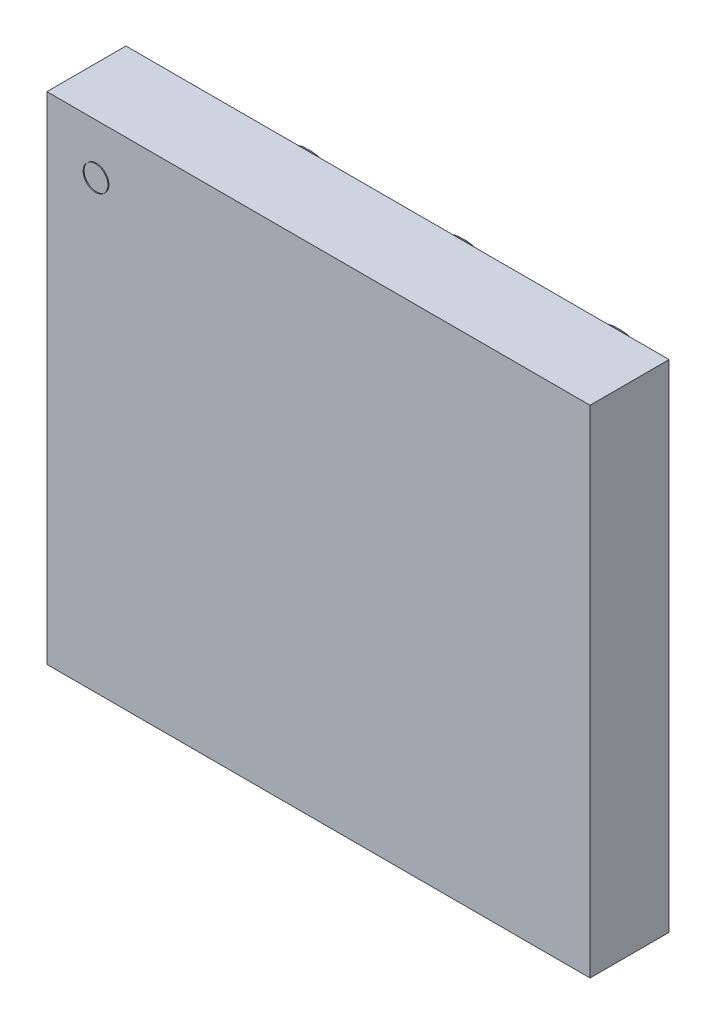
ISO-10303-21;
HEADER;
FILE_DESCRIPTION(('STEP AP214'),'2;1');
FILE_NAME('part.step','',(''),(''),'','','');
FILE_SCHEMA(('AUTOMOTIVE_DESIGN { 1 0 10303 214 1 1 1 1 }'));
ENDSEC;
DATA;
#1=APPLICATION_CONTEXT('core data for automotive mechanical design processes');
#2=APPLICATION_PROTOCOL_DEFINITION('international standard','automotive_design',2000,#1);
#3=PRODUCT_CONTEXT('',#1,'mechanical');
#4=PRODUCT('Part','Part','',(#3));
#5=PRODUCT_RELATED_PRODUCT_CATEGORY('part','',(#4));
#6=PRODUCT_DEFINITION_FORMATION('','',#4);
#7=PRODUCT_DEFINITION_CONTEXT('part definition',#1,'design');
#8=PRODUCT_DEFINITION('design','',#6,#7);
#9=PRODUCT_DEFINITION_SHAPE('','',#8);
#10=(LENGTH_UNIT() NAMED_UNIT(*) SI_UNIT(.MILLI.,.METRE.));
#11=(NAMED_UNIT(*) PLANE_ANGLE_UNIT() SI_UNIT($,.RADIAN.));
#12=(NAMED_UNIT(*) SI_UNIT($,.STERADIAN.) SOLID_ANGLE_UNIT());
#13=UNCERTAINTY_MEASURE_WITH_UNIT(LENGTH_MEASURE(1.E-05),#10,'distance_accuracy_value','');
#14=(GEOMETRIC_REPRESENTATION_CONTEXT(3) GLOBAL_UNCERTAINTY_ASSIGNED_CONTEXT((#13)) GLOBAL_UNIT_ASSIGNED_CONTEXT((#10,
#11,#12)) REPRESENTATION_CONTEXT('',''));
#15=CARTESIAN_POINT('',(0.,0.,0.));
#16=DIRECTION('',(0.,0.,1.));
#17=DIRECTION('',(1.,0.,0.));
#18=AXIS2_PLACEMENT_3D('',#15,#16,#17);
#19=CARTESIAN_POINT('',(-0.5,0.5,-0.123));
#20=DIRECTION('',(-1.,0.,0.));
#21=DIRECTION('',(0.,1.,0.));
#22=AXIS2_PLACEMENT_3D('',#19,#20,#21);
#23=SPHERICAL_SURFACE('',#22,0.127);
#24=CARTESIAN_POINT('',(-0.373,0.5,-0.123));
#25=VERTEX_POINT('',#24);
#26=VERTEX_LOOP('',#25);
#27=FACE_BOUND('',#26,.T.);
#28=CARTESIAN_POINT('',(-0.627,0.5,-0.123));
#29=VERTEX_POINT('',#28);
#30=VERTEX_LOOP('',#29);
#31=FACE_BOUND('',#30,.T.);
#32=ADVANCED_FACE('P0_F15',(#27,#31),#23,.T.);
#33=CLOSED_SHELL('',(#32));
#34=MANIFOLD_SOLID_BREP('P0_B1',#33);
#35=CARTESIAN_POINT('',(-0.5,0.,-0.123));
#36=DIRECTION('',(-1.,0.,0.));
#37=DIRECTION('',(0.,1.,0.));
#38=AXIS2_PLACEMENT_3D('',#35,#36,#37);
#39=SPHERICAL_SURFACE('',#38,0.127);
#40=CARTESIAN_POINT('',(-0.373,0.,-0.123));
#41=VERTEX_POINT('',#40);
#42=VERTEX_LOOP('',#41);
#43=FACE_BOUND('',#42,.T.);
#44=CARTESIAN_POINT('',(-0.627,0.,-0.123));
#45=VERTEX_POINT('',#44);
#46=VERTEX_LOOP('',#45);
#47=FACE_BOUND('',#46,.T.);
#48=ADVANCED_FACE('P1_F15',(#43,#47),#39,.T.);
#49=CLOSED_SHELL('',(#48));
#50=MANIFOLD_SOLID_BREP('P1_B1',#49);
#51=CARTESIAN_POINT('',(0.,0.5,-0.123));
#52=DIRECTION('',(-1.,0.,0.));
#53=DIRECTION('',(0.,1.,0.));
#54=AXIS2_PLACEMENT_3D('',#51,#52,#53);
#55=SPHERICAL_SURFACE('',#54,0.127);
#56=CARTESIAN_POINT('',(0.127,0.5,-0.123));
#57=VERTEX_POINT('',#56);
#58=VERTEX_LOOP('',#57);
#59=FACE_BOUND('',#58,.T.);
#60=CARTESIAN_POINT('',(-0.127,0.5,-0.123));
#61=VERTEX_POINT('',#60);
#62=VERTEX_LOOP('',#61);
#63=FACE_BOUND('',#62,.T.);
#64=ADVANCED_FACE('P2_F15',(#59,#63),#55,.T.);
#65=CLOSED_SHELL('',(#64));
#66=MANIFOLD_SOLID_BREP('P2_B1',#65);
#67=CARTESIAN_POINT('',(0.5,-0.5,-0.123));
#68=DIRECTION('',(-1.,0.,0.));
#69=DIRECTION('',(0.,1.,0.));
#70=AXIS2_PLACEMENT_3D('',#67,#68,#69);
#71=SPHERICAL_SURFACE('',#70,0.127);
#72=CARTESIAN_POINT('',(0.627,-0.5,-0.123));
#73=VERTEX_POINT('',#72);
#74=VERTEX_LOOP('',#73);
#75=FACE_BOUND('',#74,.T.);
#76=CARTESIAN_POINT('',(0.373,-0.5,-0.123));
#77=VERTEX_POINT('',#76);
#78=VERTEX_LOOP('',#77);
#79=FACE_BOUND('',#78,.T.);
#80=ADVANCED_FACE('P3_F15',(#75,#79),#71,.T.);
#81=CLOSED_SHELL('',(#80));
#82=MANIFOLD_SOLID_BREP('P3_B1',#81);
#83=CARTESIAN_POINT('',(-0.876,-0.8,0.258));
#84=DIRECTION('',(0.,0.,1.));
#85=DIRECTION('',(1.,0.,0.));
#86=AXIS2_PLACEMENT_3D('',#83,#84,#85);
#87=PLANE('',#86);
#88=DIRECTION('',(1.,0.,0.));
#89=VECTOR('',#88,1.);
#90=CARTESIAN_POINT('',(0.876,0.8,0.258));
#91=LINE('',#90,#89);
#92=CARTESIAN_POINT('',(-0.876,0.8,0.258));
#93=VERTEX_POINT('',#92);
#94=CARTESIAN_POINT('',(0.876,0.8,0.258));
#95=VERTEX_POINT('',#94);
#96=EDGE_CURVE('P4_E61',#93,#95,#91,.T.);
#97=ORIENTED_EDGE('',*,*,#96,.F.);
#98=DIRECTION('',(0.,1.,0.));
#99=VECTOR('',#98,1.);
#100=CARTESIAN_POINT('',(-0.876,-0.8,0.258));
#101=LINE('',#100,#99);
#102=CARTESIAN_POINT('',(-0.876,-0.8,0.258));
#103=VERTEX_POINT('',#102);
#104=EDGE_CURVE('P4_E19',#93,#103,#101,.F.);
#105=ORIENTED_EDGE('',*,*,#104,.T.);
#106=DIRECTION('',(1.,0.,0.));
#107=VECTOR('',#106,1.);
#108=CARTESIAN_POINT('',(-0.876,-0.8,0.258));
#109=LINE('',#108,#107);
#110=CARTESIAN_POINT('',(0.876,-0.8,0.258));
#111=VERTEX_POINT('',#110);
#112=EDGE_CURVE('P4_E68',#111,#103,#109,.F.);
#113=ORIENTED_EDGE('',*,*,#112,.F.);
#114=DIRECTION('',(0.,1.,0.));
#115=VECTOR('',#114,1.);
#116=CARTESIAN_POINT('',(0.876,-0.8,0.258));
#117=LINE('',#116,#115);
#118=EDGE_CURVE('P4_E55',#95,#111,#117,.F.);
#119=ORIENTED_EDGE('',*,*,#118,.F.);
#120=EDGE_LOOP('',(#97,#105,#113,#119));
#121=FACE_BOUND('',#120,.T.);
#122=ADVANCED_FACE('P4_F16',(#121),#87,.T.);
#123=CARTESIAN_POINT('',(0.876,0.8,0.00300000000000009));
#124=DIRECTION('',(0.,1.,0.));
#125=DIRECTION('',(0.,0.,1.));
#126=AXIS2_PLACEMENT_3D('',#123,#124,#125);
#127=PLANE('',#126);
#128=ORIENTED_EDGE('',*,*,#96,.T.);
#129=DIRECTION('',(0.,0.,-1.));
#130=VECTOR('',#129,1.);
#131=CARTESIAN_POINT('',(0.876,0.8,0.00300000000000009));
#132=LINE('',#131,#130);
#133=CARTESIAN_POINT('',(0.876,0.8,0.00300000000000009));
#134=VERTEX_POINT('',#133);
#135=EDGE_CURVE('P4_E63',#134,#95,#132,.F.);
#136=ORIENTED_EDGE('',*,*,#135,.F.);
#137=DIRECTION('',(-1.,0.,0.));
#138=VECTOR('',#137,1.);
#139=CARTESIAN_POINT('',(-0.876,0.8,0.00300000000000009));
#140=LINE('',#139,#138);
#141=CARTESIAN_POINT('',(-0.876,0.8,0.00300000000000009));
#142=VERTEX_POINT('',#141);
#143=EDGE_CURVE('P4_E82',#142,#134,#140,.F.);
#144=ORIENTED_EDGE('',*,*,#143,.F.);
#145=DIRECTION('',(0.,0.,1.));
#146=VECTOR('',#145,1.);
#147=CARTESIAN_POINT('',(-0.876,0.8,0.00300000000000009));
#148=LINE('',#147,#146);
#149=EDGE_CURVE('P4_E66',#93,#142,#148,.F.);
#150=ORIENTED_EDGE('',*,*,#149,.F.);
#151=EDGE_LOOP('',(#128,#136,#144,#150));
#152=FACE_BOUND('',#151,.T.);
#153=ADVANCED_FACE('P4_F62',(#152),#127,.T.);
#154=CARTESIAN_POINT('',(0.876,-0.8,0.00300000000000009));
#155=DIRECTION('',(1.,0.,0.));
#156=DIRECTION('',(0.,0.,-1.));
#157=AXIS2_PLACEMENT_3D('',#154,#155,#156);
#158=PLANE('',#157);
#159=ORIENTED_EDGE('',*,*,#118,.T.);
#160=DIRECTION('',(0.,0.,-1.));
#161=VECTOR('',#160,1.);
#162=CARTESIAN_POINT('',(0.876,-0.8,0.00300000000000009));
#163=LINE('',#162,#161);
#164=CARTESIAN_POINT('',(0.876,-0.8,0.00300000000000009));
#165=VERTEX_POINT('',#164);
#166=EDGE_CURVE('P4_E70',#165,#111,#163,.F.);
#167=ORIENTED_EDGE('',*,*,#166,.F.);
#168=DIRECTION('',(0.,1.,0.));
#169=VECTOR('',#168,1.);
#170=CARTESIAN_POINT('',(0.876,0.8,0.00300000000000009));
#171=LINE('',#170,#169);
#172=EDGE_CURVE('P4_E74',#134,#165,#171,.F.);
#173=ORIENTED_EDGE('',*,*,#172,.F.);
#174=ORIENTED_EDGE('',*,*,#135,.T.);
#175=EDGE_LOOP('',(#159,#167,#173,#174));
#176=FACE_BOUND('',#175,.T.);
#177=ADVANCED_FACE('P4_F72',(#176),#158,.T.);
#178=CARTESIAN_POINT('',(-0.876,-0.8,0.00300000000000009));
#179=DIRECTION('',(0.,-1.,0.));
#180=DIRECTION('',(0.,0.,-1.));
#181=AXIS2_PLACEMENT_3D('',#178,#179,#180);
#182=PLANE('',#181);
#183=ORIENTED_EDGE('',*,*,#112,.T.);
#184=DIRECTION('',(0.,0.,1.));
#185=VECTOR('',#184,1.);
#186=CARTESIAN_POINT('',(-0.876,-0.8,0.00300000000000009));
#187=LINE('',#186,#185);
#188=CARTESIAN_POINT('',(-0.876,-0.8,0.00300000000000009));
#189=VERTEX_POINT('',#188);
#190=EDGE_CURVE('P4_E34',#189,#103,#187,.T.);
#191=ORIENTED_EDGE('',*,*,#190,.F.);
#192=DIRECTION('',(-1.,0.,0.));
#193=VECTOR('',#192,1.);
#194=CARTESIAN_POINT('',(-0.876,-0.8,0.00300000000000009));
#195=LINE('',#194,#193);
#196=EDGE_CURVE('P4_E25',#165,#189,#195,.T.);
#197=ORIENTED_EDGE('',*,*,#196,.F.);
#198=ORIENTED_EDGE('',*,*,#166,.T.);
#199=EDGE_LOOP('',(#183,#191,#197,#198));
#200=FACE_BOUND('',#199,.T.);
#201=ADVANCED_FACE('P4_F88',(#200),#182,.T.);
#202=CARTESIAN_POINT('',(-0.876,0.8,0.00300000000000009));
#203=DIRECTION('',(-1.,0.,0.));
#204=DIRECTION('',(0.,0.,1.));
#205=AXIS2_PLACEMENT_3D('',#202,#203,#204);
#206=PLANE('',#205);
#207=ORIENTED_EDGE('',*,*,#104,.F.);
#208=ORIENTED_EDGE('',*,*,#149,.T.);
#209=DIRECTION('',(0.,1.,0.));
#210=VECTOR('',#209,1.);
#211=CARTESIAN_POINT('',(-0.876,0.8,0.00300000000000009));
#212=LINE('',#211,#210);
#213=EDGE_CURVE('P4_E11',#189,#142,#212,.T.);
#214=ORIENTED_EDGE('',*,*,#213,.F.);
#215=ORIENTED_EDGE('',*,*,#190,.T.);
#216=EDGE_LOOP('',(#207,#208,#214,#215));
#217=FACE_BOUND('',#216,.T.);
#218=ADVANCED_FACE('P4_F90',(#217),#206,.T.);
#219=CARTESIAN_POINT('',(-0.876,0.8,0.00300000000000009));
#220=DIRECTION('',(0.,0.,-1.));
#221=DIRECTION('',(-1.,0.,0.));
#222=AXIS2_PLACEMENT_3D('',#219,#220,#221);
#223=PLANE('',#222);
#224=ORIENTED_EDGE('',*,*,#196,.T.);
#225=ORIENTED_EDGE('',*,*,#213,.T.);
#226=ORIENTED_EDGE('',*,*,#143,.T.);
#227=ORIENTED_EDGE('',*,*,#172,.T.);
#228=EDGE_LOOP('',(#224,#225,#226,#227));
#229=FACE_BOUND('',#228,.T.);
#230=ADVANCED_FACE('P4_F87',(#229),#223,.T.);
#231=CLOSED_SHELL('',(#122,#153,#177,#201,#218,#230));
#232=MANIFOLD_SOLID_BREP('P4_B1',#231);
#233=CARTESIAN_POINT('',(-0.5,-0.5,-0.123));
#234=DIRECTION('',(-1.,0.,0.));
#235=DIRECTION('',(0.,1.,0.));
#236=AXIS2_PLACEMENT_3D('',#233,#234,#235);
#237=SPHERICAL_SURFACE('',#236,0.127);
#238=CARTESIAN_POINT('',(-0.373,-0.5,-0.123));
#239=VERTEX_POINT('',#238);
#240=VERTEX_LOOP('',#239);
#241=FACE_BOUND('',#240,.T.);
#242=CARTESIAN_POINT('',(-0.627,-0.5,-0.123));
#243=VERTEX_POINT('',#242);
#244=VERTEX_LOOP('',#243);
#245=FACE_BOUND('',#244,.T.);
#246=ADVANCED_FACE('P5_F15',(#241,#245),#237,.T.);
#247=CLOSED_SHELL('',(#246));
#248=MANIFOLD_SOLID_BREP('P5_B1',#247);
#249=CARTESIAN_POINT('',(0.,-0.5,-0.123));
#250=DIRECTION('',(-1.,0.,0.));
#251=DIRECTION('',(0.,1.,0.));
#252=AXIS2_PLACEMENT_3D('',#249,#250,#251);
#253=SPHERICAL_SURFACE('',#252,0.127);
#254=CARTESIAN_POINT('',(0.127,-0.5,-0.123));
#255=VERTEX_POINT('',#254);
#256=VERTEX_LOOP('',#255);
#257=FACE_BOUND('',#256,.T.);
#258=CARTESIAN_POINT('',(-0.127,-0.5,-0.123));
#259=VERTEX_POINT('',#258);
#260=VERTEX_LOOP('',#259);
#261=FACE_BOUND('',#260,.T.);
#262=ADVANCED_FACE('P6_F15',(#257,#261),#253,.T.);
#263=CLOSED_SHELL('',(#262));
#264=MANIFOLD_SOLID_BREP('P6_B1',#263);
#265=CARTESIAN_POINT('',(0.,0.,-0.123));
#266=DIRECTION('',(-1.,0.,0.));
#267=DIRECTION('',(0.,1.,0.));
#268=AXIS2_PLACEMENT_3D('',#265,#266,#267);
#269=SPHERICAL_SURFACE('',#268,0.127);
#270=CARTESIAN_POINT('',(0.127,0.,-0.123));
#271=VERTEX_POINT('',#270);
#272=VERTEX_LOOP('',#271);
#273=FACE_BOUND('',#272,.T.);
#274=CARTESIAN_POINT('',(-0.127,0.,-0.123));
#275=VERTEX_POINT('',#274);
#276=VERTEX_LOOP('',#275);
#277=FACE_BOUND('',#276,.T.);
#278=ADVANCED_FACE('P7_F15',(#273,#277),#269,.T.);
#279=CLOSED_SHELL('',(#278));
#280=MANIFOLD_SOLID_BREP('P7_B1',#279);
#281=CARTESIAN_POINT('',(0.5,0.5,-0.123));
#282=DIRECTION('',(-1.,0.,0.));
#283=DIRECTION('',(0.,1.,0.));
#284=AXIS2_PLACEMENT_3D('',#281,#282,#283);
#285=SPHERICAL_SURFACE('',#284,0.127);
#286=CARTESIAN_POINT('',(0.627,0.5,-0.123));
#287=VERTEX_POINT('',#286);
#288=VERTEX_LOOP('',#287);
#289=FACE_BOUND('',#288,.T.);
#290=CARTESIAN_POINT('',(0.373,0.5,-0.123));
#291=VERTEX_POINT('',#290);
#292=VERTEX_LOOP('',#291);
#293=FACE_BOUND('',#292,.T.);
#294=ADVANCED_FACE('P8_F15',(#289,#293),#285,.T.);
#295=CLOSED_SHELL('',(#294));
#296=MANIFOLD_SOLID_BREP('P8_B1',#295);
#297=CARTESIAN_POINT('',(0.5,0.,-0.123));
#298=DIRECTION('',(-1.,0.,0.));
#299=DIRECTION('',(0.,1.,0.));
#300=AXIS2_PLACEMENT_3D('',#297,#298,#299);
#301=SPHERICAL_SURFACE('',#300,0.127);
#302=CARTESIAN_POINT('',(0.627,0.,-0.123));
#303=VERTEX_POINT('',#302);
#304=VERTEX_LOOP('',#303);
#305=FACE_BOUND('',#304,.T.);
#306=CARTESIAN_POINT('',(0.373,0.,-0.123));
#307=VERTEX_POINT('',#306);
#308=VERTEX_LOOP('',#307);
#309=FACE_BOUND('',#308,.T.);
#310=ADVANCED_FACE('P9_F15',(#305,#309),#301,.T.);
#311=CLOSED_SHELL('',(#310));
#312=MANIFOLD_SOLID_BREP('P9_B1',#311);
#313=CARTESIAN_POINT('',(-0.716,0.64,0.258));
#314=DIRECTION('',(0.,0.,1.));
#315=DIRECTION('',(1.,0.,0.));
#316=AXIS2_PLACEMENT_3D('',#313,#314,#315);
#317=CYLINDRICAL_SURFACE('',#316,0.040005);
#318=CARTESIAN_POINT('',(-0.716,0.64,0.258));
#319=DIRECTION('',(0.,0.,1.));
#320=DIRECTION('',(1.,0.,0.));
#321=AXIS2_PLACEMENT_3D('',#318,#319,#320);
#322=CIRCLE('',#321,0.040005);
#323=CARTESIAN_POINT('',(-0.675995,0.64,0.258));
#324=VERTEX_POINT('',#323);
#325=EDGE_CURVE('P10_E10',#324,#324,#322,.T.);
#326=ORIENTED_EDGE('',*,*,#325,.T.);
#327=EDGE_LOOP('',(#326));
#328=FACE_BOUND('',#327,.T.);
#329=CARTESIAN_POINT('',(-0.716,0.64,0.261));
#330=DIRECTION('',(0.,0.,1.));
#331=DIRECTION('',(1.,0.,0.));
#332=AXIS2_PLACEMENT_3D('',#329,#330,#331);
#333=CIRCLE('',#332,0.040005);
#334=CARTESIAN_POINT('',(-0.675995,0.64,0.261));
#335=VERTEX_POINT('',#334);
#336=EDGE_CURVE('P10_E15',#335,#335,#333,.F.);
#337=ORIENTED_EDGE('',*,*,#336,.T.);
#338=EDGE_LOOP('',(#337));
#339=FACE_BOUND('',#338,.T.);
#340=ADVANCED_FACE('P10_F14',(#328,#339),#317,.T.);
#341=OPEN_SHELL('',(#340));
#342=SHELL_BASED_SURFACE_MODEL('P10_B1',(#341));
#343=ADVANCED_BREP_SHAPE_REPRESENTATION('',(#18,#34,#50,#66,#82,#232,#248,#264,#280,#296,#312),#14);
#344=MANIFOLD_SURFACE_SHAPE_REPRESENTATION('',(#18,#342),#14);
#345=SHAPE_REPRESENTATION('',(#18),#14);
#346=SHAPE_DEFINITION_REPRESENTATION(#9,#345);
#347=SHAPE_REPRESENTATION_RELATIONSHIP('','',#345,#343);
#348=SHAPE_REPRESENTATION_RELATIONSHIP('','',#345,#344);
ENDSEC;
END-ISO-10303-21;
